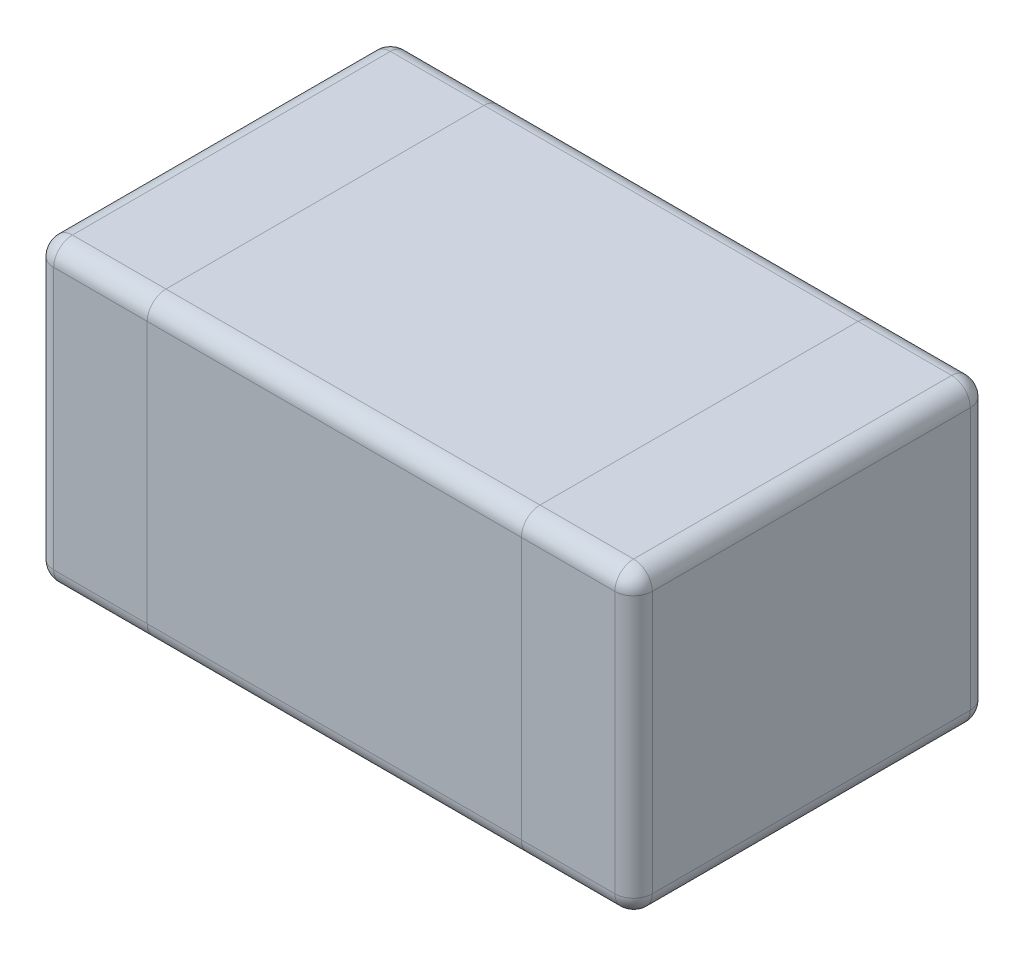
ISO-10303-21;
HEADER;
FILE_DESCRIPTION(('STEP AP214'),'2;1');
FILE_NAME('part.step','',(''),(''),'','','');
FILE_SCHEMA(('AUTOMOTIVE_DESIGN { 1 0 10303 214 1 1 1 1 }'));
ENDSEC;
DATA;
#1=APPLICATION_CONTEXT('core data for automotive mechanical design processes');
#2=APPLICATION_PROTOCOL_DEFINITION('international standard','automotive_design',2000,#1);
#3=PRODUCT_CONTEXT('',#1,'mechanical');
#4=PRODUCT('Part','Part','',(#3));
#5=PRODUCT_RELATED_PRODUCT_CATEGORY('part','',(#4));
#6=PRODUCT_DEFINITION_FORMATION('','',#4);
#7=PRODUCT_DEFINITION_CONTEXT('part definition',#1,'design');
#8=PRODUCT_DEFINITION('design','',#6,#7);
#9=PRODUCT_DEFINITION_SHAPE('','',#8);
#10=(LENGTH_UNIT() NAMED_UNIT(*) SI_UNIT(.MILLI.,.METRE.));
#11=(NAMED_UNIT(*) PLANE_ANGLE_UNIT() SI_UNIT($,.RADIAN.));
#12=(NAMED_UNIT(*) SI_UNIT($,.STERADIAN.) SOLID_ANGLE_UNIT());
#13=UNCERTAINTY_MEASURE_WITH_UNIT(LENGTH_MEASURE(1.E-05),#10,'distance_accuracy_value','');
#14=(GEOMETRIC_REPRESENTATION_CONTEXT(3) GLOBAL_UNCERTAINTY_ASSIGNED_CONTEXT((#13)) GLOBAL_UNIT_ASSIGNED_CONTEXT((#10,
#11,#12)) REPRESENTATION_CONTEXT('',''));
#15=CARTESIAN_POINT('',(0.,0.,0.));
#16=DIRECTION('',(0.,0.,1.));
#17=DIRECTION('',(1.,0.,0.));
#18=AXIS2_PLACEMENT_3D('',#15,#16,#17);
#19=CARTESIAN_POINT('',(0.8,0.40000254,0.95));
#20=DIRECTION('',(0.,0.,-1.));
#21=DIRECTION('',(0.,1.,0.));
#22=AXIS2_PLACEMENT_3D('',#19,#20,#21);
#23=PLANE('',#22);
#24=DIRECTION('',(0.,-1.,0.));
#25=VECTOR('',#24,1.);
#26=CARTESIAN_POINT('',(-0.5,0.40000254,0.95));
#27=LINE('',#26,#25);
#28=CARTESIAN_POINT('',(-0.5,0.35000254,0.95));
#29=VERTEX_POINT('',#28);
#30=CARTESIAN_POINT('',(-0.5,-0.34999746,0.95));
#31=VERTEX_POINT('',#30);
#32=EDGE_CURVE('E9',#29,#31,#27,.T.);
#33=ORIENTED_EDGE('',*,*,#32,.F.);
#34=DIRECTION('',(-1.,0.,0.));
#35=VECTOR('',#34,1.);
#36=CARTESIAN_POINT('',(0.8,0.35000254,0.95));
#37=LINE('',#36,#35);
#38=CARTESIAN_POINT('',(-0.75,0.35000254,0.95));
#39=VERTEX_POINT('',#38);
#40=EDGE_CURVE('E22',#29,#39,#37,.T.);
#41=ORIENTED_EDGE('',*,*,#40,.T.);
#42=DIRECTION('',(0.,-1.,0.));
#43=VECTOR('',#42,1.);
#44=CARTESIAN_POINT('',(-0.75,0.40000254,0.95));
#45=LINE('',#44,#43);
#46=CARTESIAN_POINT('',(-0.75,-0.34999746,0.95));
#47=VERTEX_POINT('',#46);
#48=EDGE_CURVE('E351',#39,#47,#45,.T.);
#49=ORIENTED_EDGE('',*,*,#48,.T.);
#50=DIRECTION('',(1.,0.,0.));
#51=VECTOR('',#50,1.);
#52=CARTESIAN_POINT('',(0.8,-0.34999746,0.95));
#53=LINE('',#52,#51);
#54=EDGE_CURVE('E349',#47,#31,#53,.T.);
#55=ORIENTED_EDGE('',*,*,#54,.T.);
#56=EDGE_LOOP('',(#33,#41,#49,#55));
#57=FACE_BOUND('',#56,.T.);
#58=ADVANCED_FACE('F15',(#57),#23,.F.);
#59=CARTESIAN_POINT('',(0.8,0.40000254,0.95));
#60=DIRECTION('',(0.,0.,-1.));
#61=DIRECTION('',(0.,1.,0.));
#62=AXIS2_PLACEMENT_3D('',#59,#60,#61);
#63=PLANE('',#62);
#64=DIRECTION('',(0.,1.,0.));
#65=VECTOR('',#64,1.);
#66=CARTESIAN_POINT('',(0.5,0.40000254,0.95));
#67=LINE('',#66,#65);
#68=CARTESIAN_POINT('',(0.5,-0.34999746,0.95));
#69=VERTEX_POINT('',#68);
#70=CARTESIAN_POINT('',(0.5,0.35000254,0.95));
#71=VERTEX_POINT('',#70);
#72=EDGE_CURVE('E347',#69,#71,#67,.T.);
#73=ORIENTED_EDGE('',*,*,#72,.F.);
#74=DIRECTION('',(1.,0.,0.));
#75=VECTOR('',#74,1.);
#76=CARTESIAN_POINT('',(0.8,-0.34999746,0.95));
#77=LINE('',#76,#75);
#78=CARTESIAN_POINT('',(0.75,-0.34999746,0.95));
#79=VERTEX_POINT('',#78);
#80=EDGE_CURVE('E345',#69,#79,#77,.T.);
#81=ORIENTED_EDGE('',*,*,#80,.T.);
#82=DIRECTION('',(0.,1.,0.));
#83=VECTOR('',#82,1.);
#84=CARTESIAN_POINT('',(0.75,0.40000254,0.95));
#85=LINE('',#84,#83);
#86=CARTESIAN_POINT('',(0.75,0.35000254,0.95));
#87=VERTEX_POINT('',#86);
#88=EDGE_CURVE('E343',#79,#87,#85,.T.);
#89=ORIENTED_EDGE('',*,*,#88,.T.);
#90=DIRECTION('',(-1.,0.,0.));
#91=VECTOR('',#90,1.);
#92=CARTESIAN_POINT('',(0.8,0.35000254,0.95));
#93=LINE('',#92,#91);
#94=EDGE_CURVE('E340',#87,#71,#93,.T.);
#95=ORIENTED_EDGE('',*,*,#94,.T.);
#96=EDGE_LOOP('',(#73,#81,#89,#95));
#97=FACE_BOUND('',#96,.T.);
#98=ADVANCED_FACE('F450',(#97),#63,.F.);
#99=CARTESIAN_POINT('',(0.8,-0.34999746,0.9));
#100=DIRECTION('',(1.,0.,0.));
#101=DIRECTION('',(0.,1.,0.));
#102=AXIS2_PLACEMENT_3D('',#99,#100,#101);
#103=CYLINDRICAL_SURFACE('',#102,0.05);
#104=DIRECTION('',(-1.,0.,0.));
#105=VECTOR('',#104,1.);
#106=CARTESIAN_POINT('',(-0.8,-0.39999746,0.9));
#107=LINE('',#106,#105);
#108=CARTESIAN_POINT('',(-0.5,-0.39999746,0.9));
#109=VERTEX_POINT('',#108);
#110=CARTESIAN_POINT('',(-0.75,-0.39999746,0.9));
#111=VERTEX_POINT('',#110);
#112=EDGE_CURVE('E338',#109,#111,#107,.T.);
#113=ORIENTED_EDGE('',*,*,#112,.F.);
#114=CARTESIAN_POINT('',(-0.5,-0.34999746,0.9));
#115=DIRECTION('',(-1.,0.,0.));
#116=DIRECTION('',(0.,1.,0.));
#117=AXIS2_PLACEMENT_3D('',#114,#115,#116);
#118=CIRCLE('',#117,0.05);
#119=EDGE_CURVE('E335',#109,#31,#118,.T.);
#120=ORIENTED_EDGE('',*,*,#119,.T.);
#121=ORIENTED_EDGE('',*,*,#54,.F.);
#122=CARTESIAN_POINT('',(-0.75,-0.34999746,0.9));
#123=DIRECTION('',(1.,0.,0.));
#124=DIRECTION('',(0.,0.,-1.));
#125=AXIS2_PLACEMENT_3D('',#122,#123,#124);
#126=CIRCLE('',#125,0.05);
#127=EDGE_CURVE('E332',#47,#111,#126,.T.);
#128=ORIENTED_EDGE('',*,*,#127,.T.);
#129=EDGE_LOOP('',(#113,#120,#121,#128));
#130=FACE_BOUND('',#129,.T.);
#131=ADVANCED_FACE('F454',(#130),#103,.T.);
#132=CARTESIAN_POINT('',(0.8,-0.34999746,0.9));
#133=DIRECTION('',(1.,0.,0.));
#134=DIRECTION('',(0.,1.,0.));
#135=AXIS2_PLACEMENT_3D('',#132,#133,#134);
#136=CYLINDRICAL_SURFACE('',#135,0.05);
#137=ORIENTED_EDGE('',*,*,#80,.F.);
#138=CARTESIAN_POINT('',(0.5,-0.34999746,0.9));
#139=DIRECTION('',(1.,0.,0.));
#140=DIRECTION('',(0.,-1.,0.));
#141=AXIS2_PLACEMENT_3D('',#138,#139,#140);
#142=CIRCLE('',#141,0.05);
#143=CARTESIAN_POINT('',(0.5,-0.39999746,0.9));
#144=VERTEX_POINT('',#143);
#145=EDGE_CURVE('E330',#69,#144,#142,.T.);
#146=ORIENTED_EDGE('',*,*,#145,.T.);
#147=DIRECTION('',(-1.,0.,0.));
#148=VECTOR('',#147,1.);
#149=CARTESIAN_POINT('',(-0.8,-0.39999746,0.9));
#150=LINE('',#149,#148);
#151=CARTESIAN_POINT('',(0.75,-0.39999746,0.9));
#152=VERTEX_POINT('',#151);
#153=EDGE_CURVE('E327',#152,#144,#150,.T.);
#154=ORIENTED_EDGE('',*,*,#153,.F.);
#155=CARTESIAN_POINT('',(0.75,-0.34999746,0.9));
#156=DIRECTION('',(1.,0.,0.));
#157=DIRECTION('',(0.,1.,0.));
#158=AXIS2_PLACEMENT_3D('',#155,#156,#157);
#159=CIRCLE('',#158,0.05);
#160=EDGE_CURVE('E324',#79,#152,#159,.T.);
#161=ORIENTED_EDGE('',*,*,#160,.F.);
#162=EDGE_LOOP('',(#137,#146,#154,#161));
#163=FACE_BOUND('',#162,.T.);
#164=ADVANCED_FACE('F459',(#163),#136,.T.);
#165=CARTESIAN_POINT('',(-0.8,-0.39999746,0.95));
#166=DIRECTION('',(0.,1.,0.));
#167=DIRECTION('',(0.,0.,-1.));
#168=AXIS2_PLACEMENT_3D('',#165,#166,#167);
#169=PLANE('',#168);
#170=DIRECTION('',(0.,0.,-1.));
#171=VECTOR('',#170,1.);
#172=CARTESIAN_POINT('',(-0.5,-0.39999746,0.95));
#173=LINE('',#172,#171);
#174=CARTESIAN_POINT('',(-0.5,-0.39999746,0.05));
#175=VERTEX_POINT('',#174);
#176=EDGE_CURVE('E322',#109,#175,#173,.T.);
#177=ORIENTED_EDGE('',*,*,#176,.F.);
#178=ORIENTED_EDGE('',*,*,#112,.T.);
#179=DIRECTION('',(0.,0.,-1.));
#180=VECTOR('',#179,1.);
#181=CARTESIAN_POINT('',(-0.75,-0.39999746,0.95));
#182=LINE('',#181,#180);
#183=CARTESIAN_POINT('',(-0.75,-0.39999746,0.05));
#184=VERTEX_POINT('',#183);
#185=EDGE_CURVE('E320',#111,#184,#182,.T.);
#186=ORIENTED_EDGE('',*,*,#185,.T.);
#187=DIRECTION('',(1.,0.,0.));
#188=VECTOR('',#187,1.);
#189=CARTESIAN_POINT('',(0.8,-0.39999746,0.05));
#190=LINE('',#189,#188);
#191=EDGE_CURVE('E317',#184,#175,#190,.T.);
#192=ORIENTED_EDGE('',*,*,#191,.T.);
#193=EDGE_LOOP('',(#177,#178,#186,#192));
#194=FACE_BOUND('',#193,.T.);
#195=ADVANCED_FACE('F465',(#194),#169,.F.);
#196=CARTESIAN_POINT('',(-0.8,-0.39999746,0.95));
#197=DIRECTION('',(0.,1.,0.));
#198=DIRECTION('',(0.,0.,-1.));
#199=AXIS2_PLACEMENT_3D('',#196,#197,#198);
#200=PLANE('',#199);
#201=DIRECTION('',(0.,0.,1.));
#202=VECTOR('',#201,1.);
#203=CARTESIAN_POINT('',(0.5,-0.39999746,0.95));
#204=LINE('',#203,#202);
#205=CARTESIAN_POINT('',(0.5,-0.39999746,0.05));
#206=VERTEX_POINT('',#205);
#207=EDGE_CURVE('E314',#206,#144,#204,.T.);
#208=ORIENTED_EDGE('',*,*,#207,.F.);
#209=DIRECTION('',(1.,0.,0.));
#210=VECTOR('',#209,1.);
#211=CARTESIAN_POINT('',(0.8,-0.39999746,0.05));
#212=LINE('',#211,#210);
#213=CARTESIAN_POINT('',(0.75,-0.39999746,0.05));
#214=VERTEX_POINT('',#213);
#215=EDGE_CURVE('E311',#206,#214,#212,.T.);
#216=ORIENTED_EDGE('',*,*,#215,.T.);
#217=DIRECTION('',(0.,0.,1.));
#218=VECTOR('',#217,1.);
#219=CARTESIAN_POINT('',(0.75,-0.39999746,0.95));
#220=LINE('',#219,#218);
#221=EDGE_CURVE('E308',#214,#152,#220,.T.);
#222=ORIENTED_EDGE('',*,*,#221,.T.);
#223=ORIENTED_EDGE('',*,*,#153,.T.);
#224=EDGE_LOOP('',(#208,#216,#222,#223));
#225=FACE_BOUND('',#224,.T.);
#226=ADVANCED_FACE('F390',(#225),#200,.F.);
#227=CARTESIAN_POINT('',(-0.8,-0.34999746,0.05));
#228=DIRECTION('',(-1.,0.,0.));
#229=DIRECTION('',(0.,-1.,0.));
#230=AXIS2_PLACEMENT_3D('',#227,#228,#229);
#231=CYLINDRICAL_SURFACE('',#230,0.05);
#232=DIRECTION('',(-1.,0.,0.));
#233=VECTOR('',#232,1.);
#234=CARTESIAN_POINT('',(-0.8,-0.34999746,0.));
#235=LINE('',#234,#233);
#236=CARTESIAN_POINT('',(-0.5,-0.34999746,0.));
#237=VERTEX_POINT('',#236);
#238=CARTESIAN_POINT('',(-0.75,-0.34999746,0.));
#239=VERTEX_POINT('',#238);
#240=EDGE_CURVE('E305',#237,#239,#235,.T.);
#241=ORIENTED_EDGE('',*,*,#240,.F.);
#242=CARTESIAN_POINT('',(-0.5,-0.34999746,0.05));
#243=DIRECTION('',(-1.,0.,0.));
#244=DIRECTION('',(0.,1.,0.));
#245=AXIS2_PLACEMENT_3D('',#242,#243,#244);
#246=CIRCLE('',#245,0.05);
#247=EDGE_CURVE('E302',#237,#175,#246,.T.);
#248=ORIENTED_EDGE('',*,*,#247,.T.);
#249=ORIENTED_EDGE('',*,*,#191,.F.);
#250=CARTESIAN_POINT('',(-0.75,-0.34999746,0.05));
#251=DIRECTION('',(1.,0.,0.));
#252=DIRECTION('',(0.,-1.,0.));
#253=AXIS2_PLACEMENT_3D('',#250,#251,#252);
#254=CIRCLE('',#253,0.05);
#255=EDGE_CURVE('E299',#184,#239,#254,.T.);
#256=ORIENTED_EDGE('',*,*,#255,.T.);
#257=EDGE_LOOP('',(#241,#248,#249,#256));
#258=FACE_BOUND('',#257,.T.);
#259=ADVANCED_FACE('F377',(#258),#231,.T.);
#260=CARTESIAN_POINT('',(-0.8,-0.34999746,0.05));
#261=DIRECTION('',(-1.,0.,0.));
#262=DIRECTION('',(0.,-1.,0.));
#263=AXIS2_PLACEMENT_3D('',#260,#261,#262);
#264=CYLINDRICAL_SURFACE('',#263,0.05);
#265=ORIENTED_EDGE('',*,*,#215,.F.);
#266=CARTESIAN_POINT('',(0.5,-0.34999746,0.05));
#267=DIRECTION('',(1.,0.,0.));
#268=DIRECTION('',(0.,-1.,0.));
#269=AXIS2_PLACEMENT_3D('',#266,#267,#268);
#270=CIRCLE('',#269,0.05);
#271=CARTESIAN_POINT('',(0.5,-0.34999746,0.));
#272=VERTEX_POINT('',#271);
#273=EDGE_CURVE('E296',#206,#272,#270,.T.);
#274=ORIENTED_EDGE('',*,*,#273,.T.);
#275=DIRECTION('',(-1.,0.,0.));
#276=VECTOR('',#275,1.);
#277=CARTESIAN_POINT('',(-0.8,-0.34999746,0.));
#278=LINE('',#277,#276);
#279=CARTESIAN_POINT('',(0.75,-0.34999746,0.));
#280=VERTEX_POINT('',#279);
#281=EDGE_CURVE('E293',#280,#272,#278,.T.);
#282=ORIENTED_EDGE('',*,*,#281,.F.);
#283=CARTESIAN_POINT('',(0.75,-0.34999746,0.05));
#284=DIRECTION('',(1.,0.,0.));
#285=DIRECTION('',(0.,1.,0.));
#286=AXIS2_PLACEMENT_3D('',#283,#284,#285);
#287=CIRCLE('',#286,0.05);
#288=EDGE_CURVE('E290',#214,#280,#287,.T.);
#289=ORIENTED_EDGE('',*,*,#288,.F.);
#290=EDGE_LOOP('',(#265,#274,#282,#289));
#291=FACE_BOUND('',#290,.T.);
#292=ADVANCED_FACE('F395',(#291),#264,.T.);
#293=CARTESIAN_POINT('',(0.8,0.40000254,0.));
#294=DIRECTION('',(0.,0.,-1.));
#295=DIRECTION('',(0.,1.,0.));
#296=AXIS2_PLACEMENT_3D('',#293,#294,#295);
#297=PLANE('',#296);
#298=DIRECTION('',(1.,0.,0.));
#299=VECTOR('',#298,1.);
#300=CARTESIAN_POINT('',(0.8,0.35000254,0.));
#301=LINE('',#300,#299);
#302=CARTESIAN_POINT('',(-0.75,0.35000254,0.));
#303=VERTEX_POINT('',#302);
#304=CARTESIAN_POINT('',(-0.5,0.35000254,0.));
#305=VERTEX_POINT('',#304);
#306=EDGE_CURVE('E287',#303,#305,#301,.T.);
#307=ORIENTED_EDGE('',*,*,#306,.T.);
#308=DIRECTION('',(0.,-1.,0.));
#309=VECTOR('',#308,1.);
#310=CARTESIAN_POINT('',(-0.5,0.40000254,0.));
#311=LINE('',#310,#309);
#312=EDGE_CURVE('E284',#305,#237,#311,.T.);
#313=ORIENTED_EDGE('',*,*,#312,.T.);
#314=ORIENTED_EDGE('',*,*,#240,.T.);
#315=DIRECTION('',(0.,1.,0.));
#316=VECTOR('',#315,1.);
#317=CARTESIAN_POINT('',(-0.75,0.40000254,0.));
#318=LINE('',#317,#316);
#319=EDGE_CURVE('E282',#239,#303,#318,.T.);
#320=ORIENTED_EDGE('',*,*,#319,.T.);
#321=EDGE_LOOP('',(#307,#313,#314,#320));
#322=FACE_BOUND('',#321,.T.);
#323=ADVANCED_FACE('F372',(#322),#297,.T.);
#324=CARTESIAN_POINT('',(0.8,0.40000254,0.));
#325=DIRECTION('',(0.,0.,-1.));
#326=DIRECTION('',(0.,1.,0.));
#327=AXIS2_PLACEMENT_3D('',#324,#325,#326);
#328=PLANE('',#327);
#329=ORIENTED_EDGE('',*,*,#281,.T.);
#330=DIRECTION('',(0.,1.,0.));
#331=VECTOR('',#330,1.);
#332=CARTESIAN_POINT('',(0.5,0.40000254,0.));
#333=LINE('',#332,#331);
#334=CARTESIAN_POINT('',(0.5,0.35000254,0.));
#335=VERTEX_POINT('',#334);
#336=EDGE_CURVE('E279',#272,#335,#333,.T.);
#337=ORIENTED_EDGE('',*,*,#336,.T.);
#338=DIRECTION('',(1.,0.,0.));
#339=VECTOR('',#338,1.);
#340=CARTESIAN_POINT('',(0.8,0.35000254,0.));
#341=LINE('',#340,#339);
#342=CARTESIAN_POINT('',(0.75,0.35000254,0.));
#343=VERTEX_POINT('',#342);
#344=EDGE_CURVE('E276',#335,#343,#341,.T.);
#345=ORIENTED_EDGE('',*,*,#344,.T.);
#346=DIRECTION('',(0.,-1.,0.));
#347=VECTOR('',#346,1.);
#348=CARTESIAN_POINT('',(0.75,-0.39999746,0.));
#349=LINE('',#348,#347);
#350=EDGE_CURVE('E273',#343,#280,#349,.T.);
#351=ORIENTED_EDGE('',*,*,#350,.T.);
#352=EDGE_LOOP('',(#329,#337,#345,#351));
#353=FACE_BOUND('',#352,.T.);
#354=ADVANCED_FACE('F405',(#353),#328,.T.);
#355=CARTESIAN_POINT('',(0.8,0.35000254,0.9));
#356=DIRECTION('',(-1.,0.,0.));
#357=DIRECTION('',(0.,-1.,0.));
#358=AXIS2_PLACEMENT_3D('',#355,#356,#357);
#359=CYLINDRICAL_SURFACE('',#358,0.05);
#360=ORIENTED_EDGE('',*,*,#40,.F.);
#361=CARTESIAN_POINT('',(-0.5,0.35000254,0.9));
#362=DIRECTION('',(-1.,0.,0.));
#363=DIRECTION('',(0.,1.,0.));
#364=AXIS2_PLACEMENT_3D('',#361,#362,#363);
#365=CIRCLE('',#364,0.05);
#366=CARTESIAN_POINT('',(-0.5,0.40000254,0.9));
#367=VERTEX_POINT('',#366);
#368=EDGE_CURVE('E270',#29,#367,#365,.T.);
#369=ORIENTED_EDGE('',*,*,#368,.T.);
#370=DIRECTION('',(1.,0.,0.));
#371=VECTOR('',#370,1.);
#372=CARTESIAN_POINT('',(-0.8,0.40000254,0.9));
#373=LINE('',#372,#371);
#374=CARTESIAN_POINT('',(-0.75,0.40000254,0.9));
#375=VERTEX_POINT('',#374);
#376=EDGE_CURVE('E267',#375,#367,#373,.T.);
#377=ORIENTED_EDGE('',*,*,#376,.F.);
#378=CARTESIAN_POINT('',(-0.75,0.35000254,0.9));
#379=DIRECTION('',(1.,0.,0.));
#380=DIRECTION('',(0.,-1.,0.));
#381=AXIS2_PLACEMENT_3D('',#378,#379,#380);
#382=CIRCLE('',#381,0.05);
#383=EDGE_CURVE('E264',#375,#39,#382,.T.);
#384=ORIENTED_EDGE('',*,*,#383,.T.);
#385=EDGE_LOOP('',(#360,#369,#377,#384));
#386=FACE_BOUND('',#385,.T.);
#387=ADVANCED_FACE('F363',(#386),#359,.T.);
#388=CARTESIAN_POINT('',(0.8,0.35000254,0.9));
#389=DIRECTION('',(-1.,0.,0.));
#390=DIRECTION('',(0.,-1.,0.));
#391=AXIS2_PLACEMENT_3D('',#388,#389,#390);
#392=CYLINDRICAL_SURFACE('',#391,0.05);
#393=DIRECTION('',(1.,0.,0.));
#394=VECTOR('',#393,1.);
#395=CARTESIAN_POINT('',(-0.8,0.40000254,0.9));
#396=LINE('',#395,#394);
#397=CARTESIAN_POINT('',(0.5,0.40000254,0.9));
#398=VERTEX_POINT('',#397);
#399=CARTESIAN_POINT('',(0.75,0.40000254,0.9));
#400=VERTEX_POINT('',#399);
#401=EDGE_CURVE('E261',#398,#400,#396,.T.);
#402=ORIENTED_EDGE('',*,*,#401,.F.);
#403=CARTESIAN_POINT('',(0.5,0.35000254,0.9));
#404=DIRECTION('',(1.,0.,0.));
#405=DIRECTION('',(0.,-1.,0.));
#406=AXIS2_PLACEMENT_3D('',#403,#404,#405);
#407=CIRCLE('',#406,0.05);
#408=EDGE_CURVE('E258',#398,#71,#407,.T.);
#409=ORIENTED_EDGE('',*,*,#408,.T.);
#410=ORIENTED_EDGE('',*,*,#94,.F.);
#411=CARTESIAN_POINT('',(0.75,0.35000254,0.9));
#412=DIRECTION('',(1.,0.,0.));
#413=DIRECTION('',(0.,0.,1.));
#414=AXIS2_PLACEMENT_3D('',#411,#412,#413);
#415=CIRCLE('',#414,0.05);
#416=EDGE_CURVE('E255',#400,#87,#415,.T.);
#417=ORIENTED_EDGE('',*,*,#416,.F.);
#418=EDGE_LOOP('',(#402,#409,#410,#417));
#419=FACE_BOUND('',#418,.T.);
#420=ADVANCED_FACE('F482',(#419),#392,.T.);
#421=CARTESIAN_POINT('',(-0.8,0.35000254,0.05));
#422=DIRECTION('',(1.,0.,0.));
#423=DIRECTION('',(0.,1.,0.));
#424=AXIS2_PLACEMENT_3D('',#421,#422,#423);
#425=CYLINDRICAL_SURFACE('',#424,0.05);
#426=DIRECTION('',(-1.,0.,0.));
#427=VECTOR('',#426,1.);
#428=CARTESIAN_POINT('',(-0.8,0.40000254,0.05));
#429=LINE('',#428,#427);
#430=CARTESIAN_POINT('',(-0.5,0.40000254,0.05));
#431=VERTEX_POINT('',#430);
#432=CARTESIAN_POINT('',(-0.75,0.40000254,0.05));
#433=VERTEX_POINT('',#432);
#434=EDGE_CURVE('E253',#431,#433,#429,.T.);
#435=ORIENTED_EDGE('',*,*,#434,.F.);
#436=CARTESIAN_POINT('',(-0.5,0.35000254,0.05));
#437=DIRECTION('',(-1.,0.,0.));
#438=DIRECTION('',(0.,1.,0.));
#439=AXIS2_PLACEMENT_3D('',#436,#437,#438);
#440=CIRCLE('',#439,0.05);
#441=EDGE_CURVE('E250',#431,#305,#440,.T.);
#442=ORIENTED_EDGE('',*,*,#441,.T.);
#443=ORIENTED_EDGE('',*,*,#306,.F.);
#444=CARTESIAN_POINT('',(-0.75,0.35000254,0.05));
#445=DIRECTION('',(1.,0.,0.));
#446=DIRECTION('',(0.,-1.,0.));
#447=AXIS2_PLACEMENT_3D('',#444,#445,#446);
#448=CIRCLE('',#447,0.05);
#449=EDGE_CURVE('E182',#303,#433,#448,.T.);
#450=ORIENTED_EDGE('',*,*,#449,.T.);
#451=EDGE_LOOP('',(#435,#442,#443,#450));
#452=FACE_BOUND('',#451,.T.);
#453=ADVANCED_FACE('F370',(#452),#425,.T.);
#454=CARTESIAN_POINT('',(-0.8,0.35000254,0.05));
#455=DIRECTION('',(1.,0.,0.));
#456=DIRECTION('',(0.,1.,0.));
#457=AXIS2_PLACEMENT_3D('',#454,#455,#456);
#458=CYLINDRICAL_SURFACE('',#457,0.05);
#459=ORIENTED_EDGE('',*,*,#344,.F.);
#460=CARTESIAN_POINT('',(0.5,0.35000254,0.05));
#461=DIRECTION('',(1.,0.,0.));
#462=DIRECTION('',(0.,-1.,0.));
#463=AXIS2_PLACEMENT_3D('',#460,#461,#462);
#464=CIRCLE('',#463,0.05);
#465=CARTESIAN_POINT('',(0.5,0.40000254,0.05));
#466=VERTEX_POINT('',#465);
#467=EDGE_CURVE('E246',#335,#466,#464,.T.);
#468=ORIENTED_EDGE('',*,*,#467,.T.);
#469=DIRECTION('',(-1.,0.,0.));
#470=VECTOR('',#469,1.);
#471=CARTESIAN_POINT('',(-0.8,0.40000254,0.05));
#472=LINE('',#471,#470);
#473=CARTESIAN_POINT('',(0.75,0.40000254,0.05));
#474=VERTEX_POINT('',#473);
#475=EDGE_CURVE('E243',#474,#466,#472,.T.);
#476=ORIENTED_EDGE('',*,*,#475,.F.);
#477=CARTESIAN_POINT('',(0.75,0.35000254,0.05));
#478=DIRECTION('',(1.,0.,0.));
#479=DIRECTION('',(0.,1.,0.));
#480=AXIS2_PLACEMENT_3D('',#477,#478,#479);
#481=CIRCLE('',#480,0.05);
#482=EDGE_CURVE('E240',#343,#474,#481,.T.);
#483=ORIENTED_EDGE('',*,*,#482,.F.);
#484=EDGE_LOOP('',(#459,#468,#476,#483));
#485=FACE_BOUND('',#484,.T.);
#486=ADVANCED_FACE('F434',(#485),#458,.T.);
#487=CARTESIAN_POINT('',(-0.8,0.40000254,0.95));
#488=DIRECTION('',(0.,-1.,0.));
#489=DIRECTION('',(1.,0.,0.));
#490=AXIS2_PLACEMENT_3D('',#487,#488,#489);
#491=PLANE('',#490);
#492=DIRECTION('',(0.,0.,1.));
#493=VECTOR('',#492,1.);
#494=CARTESIAN_POINT('',(-0.5,0.40000254,0.95));
#495=LINE('',#494,#493);
#496=EDGE_CURVE('E238',#431,#367,#495,.T.);
#497=ORIENTED_EDGE('',*,*,#496,.F.);
#498=ORIENTED_EDGE('',*,*,#434,.T.);
#499=DIRECTION('',(0.,0.,1.));
#500=VECTOR('',#499,1.);
#501=CARTESIAN_POINT('',(-0.75,0.40000254,0.95));
#502=LINE('',#501,#500);
#503=EDGE_CURVE('E173',#433,#375,#502,.T.);
#504=ORIENTED_EDGE('',*,*,#503,.T.);
#505=ORIENTED_EDGE('',*,*,#376,.T.);
#506=EDGE_LOOP('',(#497,#498,#504,#505));
#507=FACE_BOUND('',#506,.T.);
#508=ADVANCED_FACE('F366',(#507),#491,.F.);
#509=CARTESIAN_POINT('',(-0.8,0.40000254,0.95));
#510=DIRECTION('',(0.,-1.,0.));
#511=DIRECTION('',(1.,0.,0.));
#512=AXIS2_PLACEMENT_3D('',#509,#510,#511);
#513=PLANE('',#512);
#514=DIRECTION('',(0.,0.,-1.));
#515=VECTOR('',#514,1.);
#516=CARTESIAN_POINT('',(0.5,0.40000254,0.95));
#517=LINE('',#516,#515);
#518=EDGE_CURVE('E235',#398,#466,#517,.T.);
#519=ORIENTED_EDGE('',*,*,#518,.F.);
#520=ORIENTED_EDGE('',*,*,#401,.T.);
#521=DIRECTION('',(0.,0.,-1.));
#522=VECTOR('',#521,1.);
#523=CARTESIAN_POINT('',(0.75,0.40000254,0.95));
#524=LINE('',#523,#522);
#525=EDGE_CURVE('E233',#400,#474,#524,.T.);
#526=ORIENTED_EDGE('',*,*,#525,.T.);
#527=ORIENTED_EDGE('',*,*,#475,.T.);
#528=EDGE_LOOP('',(#519,#520,#526,#527));
#529=FACE_BOUND('',#528,.T.);
#530=ADVANCED_FACE('F492',(#529),#513,.F.);
#531=CARTESIAN_POINT('',(0.8,-0.39999746,0.95));
#532=DIRECTION('',(-1.,0.,0.));
#533=DIRECTION('',(0.,-1.,0.));
#534=AXIS2_PLACEMENT_3D('',#531,#532,#533);
#535=PLANE('',#534);
#536=DIRECTION('',(0.,0.,1.));
#537=VECTOR('',#536,1.);
#538=CARTESIAN_POINT('',(0.8,0.35000254,0.95));
#539=LINE('',#538,#537);
#540=CARTESIAN_POINT('',(0.8,0.35000254,0.05));
#541=VERTEX_POINT('',#540);
#542=CARTESIAN_POINT('',(0.8,0.35000254,0.9));
#543=VERTEX_POINT('',#542);
#544=EDGE_CURVE('E231',#541,#543,#539,.T.);
#545=ORIENTED_EDGE('',*,*,#544,.T.);
#546=DIRECTION('',(0.,-1.,0.));
#547=VECTOR('',#546,1.);
#548=CARTESIAN_POINT('',(0.8,-0.39999746,0.9));
#549=LINE('',#548,#547);
#550=CARTESIAN_POINT('',(0.8,-0.34999746,0.9));
#551=VERTEX_POINT('',#550);
#552=EDGE_CURVE('E229',#543,#551,#549,.T.);
#553=ORIENTED_EDGE('',*,*,#552,.T.);
#554=DIRECTION('',(0.,0.,-1.));
#555=VECTOR('',#554,1.);
#556=CARTESIAN_POINT('',(0.8,-0.34999746,0.95));
#557=LINE('',#556,#555);
#558=CARTESIAN_POINT('',(0.8,-0.34999746,0.05));
#559=VERTEX_POINT('',#558);
#560=EDGE_CURVE('E227',#551,#559,#557,.T.);
#561=ORIENTED_EDGE('',*,*,#560,.T.);
#562=DIRECTION('',(0.,1.,0.));
#563=VECTOR('',#562,1.);
#564=CARTESIAN_POINT('',(0.8,0.40000254,0.05));
#565=LINE('',#564,#563);
#566=EDGE_CURVE('E224',#559,#541,#565,.T.);
#567=ORIENTED_EDGE('',*,*,#566,.T.);
#568=EDGE_LOOP('',(#545,#553,#561,#567));
#569=FACE_BOUND('',#568,.T.);
#570=ADVANCED_FACE('F495',(#569),#535,.F.);
#571=CARTESIAN_POINT('',(-0.8,0.40000254,0.95));
#572=DIRECTION('',(0.,-1.,0.));
#573=DIRECTION('',(1.,0.,0.));
#574=AXIS2_PLACEMENT_3D('',#571,#572,#573);
#575=PLANE('',#574);
#576=DIRECTION('',(-1.,0.,0.));
#577=VECTOR('',#576,1.);
#578=CARTESIAN_POINT('',(-0.8,0.40000254,0.05));
#579=LINE('',#578,#577);
#580=EDGE_CURVE('E221',#466,#431,#579,.T.);
#581=ORIENTED_EDGE('',*,*,#580,.T.);
#582=ORIENTED_EDGE('',*,*,#496,.T.);
#583=DIRECTION('',(1.,0.,0.));
#584=VECTOR('',#583,1.);
#585=CARTESIAN_POINT('',(-0.8,0.40000254,0.9));
#586=LINE('',#585,#584);
#587=EDGE_CURVE('E218',#367,#398,#586,.T.);
#588=ORIENTED_EDGE('',*,*,#587,.T.);
#589=ORIENTED_EDGE('',*,*,#518,.T.);
#590=EDGE_LOOP('',(#581,#582,#588,#589));
#591=FACE_BOUND('',#590,.T.);
#592=ADVANCED_FACE('F498',(#591),#575,.F.);
#593=CARTESIAN_POINT('',(-0.8,-0.39999746,0.95));
#594=DIRECTION('',(1.,0.,0.));
#595=DIRECTION('',(0.,0.,1.));
#596=AXIS2_PLACEMENT_3D('',#593,#594,#595);
#597=PLANE('',#596);
#598=DIRECTION('',(0.,0.,1.));
#599=VECTOR('',#598,1.);
#600=CARTESIAN_POINT('',(-0.8,-0.34999746,0.95));
#601=LINE('',#600,#599);
#602=CARTESIAN_POINT('',(-0.8,-0.34999746,0.05));
#603=VERTEX_POINT('',#602);
#604=CARTESIAN_POINT('',(-0.8,-0.34999746,0.9));
#605=VERTEX_POINT('',#604);
#606=EDGE_CURVE('E216',#603,#605,#601,.T.);
#607=ORIENTED_EDGE('',*,*,#606,.T.);
#608=DIRECTION('',(0.,1.,0.));
#609=VECTOR('',#608,1.);
#610=CARTESIAN_POINT('',(-0.8,-0.39999746,0.9));
#611=LINE('',#610,#609);
#612=CARTESIAN_POINT('',(-0.8,0.35000254,0.9));
#613=VERTEX_POINT('',#612);
#614=EDGE_CURVE('E154',#605,#613,#611,.T.);
#615=ORIENTED_EDGE('',*,*,#614,.T.);
#616=DIRECTION('',(0.,0.,-1.));
#617=VECTOR('',#616,1.);
#618=CARTESIAN_POINT('',(-0.8,0.35000254,0.95));
#619=LINE('',#618,#617);
#620=CARTESIAN_POINT('',(-0.8,0.35000254,0.05));
#621=VERTEX_POINT('',#620);
#622=EDGE_CURVE('E148',#613,#621,#619,.T.);
#623=ORIENTED_EDGE('',*,*,#622,.T.);
#624=DIRECTION('',(0.,-1.,0.));
#625=VECTOR('',#624,1.);
#626=CARTESIAN_POINT('',(-0.8,-0.39999746,0.05));
#627=LINE('',#626,#625);
#628=EDGE_CURVE('E151',#621,#603,#627,.T.);
#629=ORIENTED_EDGE('',*,*,#628,.T.);
#630=EDGE_LOOP('',(#607,#615,#623,#629));
#631=FACE_BOUND('',#630,.T.);
#632=ADVANCED_FACE('F150',(#631),#597,.F.);
#633=CARTESIAN_POINT('',(-0.8,-0.39999746,0.95));
#634=DIRECTION('',(0.,1.,0.));
#635=DIRECTION('',(0.,0.,-1.));
#636=AXIS2_PLACEMENT_3D('',#633,#634,#635);
#637=PLANE('',#636);
#638=DIRECTION('',(-1.,0.,0.));
#639=VECTOR('',#638,1.);
#640=CARTESIAN_POINT('',(-0.8,-0.39999746,0.9));
#641=LINE('',#640,#639);
#642=EDGE_CURVE('E168',#144,#109,#641,.T.);
#643=ORIENTED_EDGE('',*,*,#642,.T.);
#644=ORIENTED_EDGE('',*,*,#176,.T.);
#645=DIRECTION('',(1.,0.,0.));
#646=VECTOR('',#645,1.);
#647=CARTESIAN_POINT('',(0.8,-0.39999746,0.05));
#648=LINE('',#647,#646);
#649=EDGE_CURVE('E211',#175,#206,#648,.T.);
#650=ORIENTED_EDGE('',*,*,#649,.T.);
#651=ORIENTED_EDGE('',*,*,#207,.T.);
#652=EDGE_LOOP('',(#643,#644,#650,#651));
#653=FACE_BOUND('',#652,.T.);
#654=ADVANCED_FACE('F386',(#653),#637,.F.);
#655=CARTESIAN_POINT('',(0.8,0.40000254,0.95));
#656=DIRECTION('',(0.,0.,-1.));
#657=DIRECTION('',(0.,1.,0.));
#658=AXIS2_PLACEMENT_3D('',#655,#656,#657);
#659=PLANE('',#658);
#660=DIRECTION('',(-1.,0.,0.));
#661=VECTOR('',#660,1.);
#662=CARTESIAN_POINT('',(0.8,0.35000254,0.95));
#663=LINE('',#662,#661);
#664=EDGE_CURVE('E209',#71,#29,#663,.T.);
#665=ORIENTED_EDGE('',*,*,#664,.T.);
#666=ORIENTED_EDGE('',*,*,#32,.T.);
#667=DIRECTION('',(1.,0.,0.));
#668=VECTOR('',#667,1.);
#669=CARTESIAN_POINT('',(0.8,-0.34999746,0.95));
#670=LINE('',#669,#668);
#671=EDGE_CURVE('E207',#31,#69,#670,.T.);
#672=ORIENTED_EDGE('',*,*,#671,.T.);
#673=ORIENTED_EDGE('',*,*,#72,.T.);
#674=EDGE_LOOP('',(#665,#666,#672,#673));
#675=FACE_BOUND('',#674,.T.);
#676=ADVANCED_FACE('F507',(#675),#659,.F.);
#677=CARTESIAN_POINT('',(0.8,0.40000254,0.));
#678=DIRECTION('',(0.,0.,-1.));
#679=DIRECTION('',(0.,1.,0.));
#680=AXIS2_PLACEMENT_3D('',#677,#678,#679);
#681=PLANE('',#680);
#682=ORIENTED_EDGE('',*,*,#312,.F.);
#683=DIRECTION('',(1.,0.,0.));
#684=VECTOR('',#683,1.);
#685=CARTESIAN_POINT('',(0.8,0.35000254,0.));
#686=LINE('',#685,#684);
#687=EDGE_CURVE('E205',#305,#335,#686,.T.);
#688=ORIENTED_EDGE('',*,*,#687,.T.);
#689=ORIENTED_EDGE('',*,*,#336,.F.);
#690=DIRECTION('',(-1.,0.,0.));
#691=VECTOR('',#690,1.);
#692=CARTESIAN_POINT('',(-0.8,-0.34999746,0.));
#693=LINE('',#692,#691);
#694=EDGE_CURVE('E203',#272,#237,#693,.T.);
#695=ORIENTED_EDGE('',*,*,#694,.T.);
#696=EDGE_LOOP('',(#682,#688,#689,#695));
#697=FACE_BOUND('',#696,.T.);
#698=ADVANCED_FACE('F510',(#697),#681,.T.);
#699=CARTESIAN_POINT('',(-0.75,-0.34999746,0.95));
#700=DIRECTION('',(0.,0.,-1.));
#701=DIRECTION('',(0.,1.,0.));
#702=AXIS2_PLACEMENT_3D('',#699,#700,#701);
#703=CYLINDRICAL_SURFACE('',#702,0.05);
#704=CARTESIAN_POINT('',(-0.75,-0.34999746,0.9));
#705=DIRECTION('',(0.,0.,1.));
#706=DIRECTION('',(0.,-1.,0.));
#707=AXIS2_PLACEMENT_3D('',#704,#705,#706);
#708=CIRCLE('',#707,0.05);
#709=EDGE_CURVE('E200',#605,#111,#708,.T.);
#710=ORIENTED_EDGE('',*,*,#709,.F.);
#711=ORIENTED_EDGE('',*,*,#606,.F.);
#712=CARTESIAN_POINT('',(-0.75,-0.34999746,0.05));
#713=DIRECTION('',(0.,0.,-1.));
#714=DIRECTION('',(0.,1.,0.));
#715=AXIS2_PLACEMENT_3D('',#712,#713,#714);
#716=CIRCLE('',#715,0.05);
#717=EDGE_CURVE('E198',#184,#603,#716,.T.);
#718=ORIENTED_EDGE('',*,*,#717,.F.);
#719=ORIENTED_EDGE('',*,*,#185,.F.);
#720=EDGE_LOOP('',(#710,#711,#718,#719));
#721=FACE_BOUND('',#720,.T.);
#722=ADVANCED_FACE('F513',(#721),#703,.T.);
#723=CARTESIAN_POINT('',(-0.75,-0.34999746,0.9));
#724=DIRECTION('',(0.,1.,0.));
#725=DIRECTION('',(1.,0.,0.));
#726=AXIS2_PLACEMENT_3D('',#723,#724,#725);
#727=SPHERICAL_SURFACE('',#726,0.05);
#728=CARTESIAN_POINT('',(-0.75,-0.34999746,0.9));
#729=DIRECTION('',(0.,1.,0.));
#730=DIRECTION('',(1.,0.,0.));
#731=AXIS2_PLACEMENT_3D('',#728,#729,#730);
#732=CIRCLE('',#731,0.05);
#733=EDGE_CURVE('E195',#605,#47,#732,.T.);
#734=ORIENTED_EDGE('',*,*,#733,.F.);
#735=ORIENTED_EDGE('',*,*,#709,.T.);
#736=ORIENTED_EDGE('',*,*,#127,.F.);
#737=EDGE_LOOP('',(#734,#735,#736));
#738=FACE_BOUND('',#737,.T.);
#739=ADVANCED_FACE('F517',(#738),#727,.T.);
#740=CARTESIAN_POINT('',(-0.75,-0.34999746,0.05));
#741=DIRECTION('',(0.,1.,0.));
#742=DIRECTION('',(1.,0.,0.));
#743=AXIS2_PLACEMENT_3D('',#740,#741,#742);
#744=SPHERICAL_SURFACE('',#743,0.05);
#745=ORIENTED_EDGE('',*,*,#255,.F.);
#746=ORIENTED_EDGE('',*,*,#717,.T.);
#747=CARTESIAN_POINT('',(-0.75,-0.34999746,0.05));
#748=DIRECTION('',(0.,1.,0.));
#749=DIRECTION('',(1.,0.,0.));
#750=AXIS2_PLACEMENT_3D('',#747,#748,#749);
#751=CIRCLE('',#750,0.05);
#752=EDGE_CURVE('E166',#239,#603,#751,.T.);
#753=ORIENTED_EDGE('',*,*,#752,.F.);
#754=EDGE_LOOP('',(#745,#746,#753));
#755=FACE_BOUND('',#754,.T.);
#756=ADVANCED_FACE('F521',(#755),#744,.T.);
#757=CARTESIAN_POINT('',(0.8,-0.34999746,0.9));
#758=DIRECTION('',(1.,0.,0.));
#759=DIRECTION('',(0.,1.,0.));
#760=AXIS2_PLACEMENT_3D('',#757,#758,#759);
#761=CYLINDRICAL_SURFACE('',#760,0.05);
#762=ORIENTED_EDGE('',*,*,#119,.F.);
#763=ORIENTED_EDGE('',*,*,#642,.F.);
#764=ORIENTED_EDGE('',*,*,#145,.F.);
#765=ORIENTED_EDGE('',*,*,#671,.F.);
#766=EDGE_LOOP('',(#762,#763,#764,#765));
#767=FACE_BOUND('',#766,.T.);
#768=ADVANCED_FACE('F525',(#767),#761,.T.);
#769=CARTESIAN_POINT('',(-0.75,0.40000254,0.9));
#770=DIRECTION('',(0.,-1.,0.));
#771=DIRECTION('',(1.,0.,0.));
#772=AXIS2_PLACEMENT_3D('',#769,#770,#771);
#773=CYLINDRICAL_SURFACE('',#772,0.05);
#774=ORIENTED_EDGE('',*,*,#733,.T.);
#775=ORIENTED_EDGE('',*,*,#48,.F.);
#776=CARTESIAN_POINT('',(-0.75,0.35000254,0.9));
#777=DIRECTION('',(0.,1.,0.));
#778=DIRECTION('',(-1.,0.,0.));
#779=AXIS2_PLACEMENT_3D('',#776,#777,#778);
#780=CIRCLE('',#779,0.05);
#781=EDGE_CURVE('E177',#613,#39,#780,.T.);
#782=ORIENTED_EDGE('',*,*,#781,.F.);
#783=ORIENTED_EDGE('',*,*,#614,.F.);
#784=EDGE_LOOP('',(#774,#775,#782,#783));
#785=FACE_BOUND('',#784,.T.);
#786=ADVANCED_FACE('F357',(#785),#773,.T.);
#787=CARTESIAN_POINT('',(-0.75,0.35000254,0.95));
#788=DIRECTION('',(0.,0.,-1.));
#789=DIRECTION('',(0.,1.,0.));
#790=AXIS2_PLACEMENT_3D('',#787,#788,#789);
#791=CYLINDRICAL_SURFACE('',#790,0.05);
#792=CARTESIAN_POINT('',(-0.75,0.35000254,0.05));
#793=DIRECTION('',(0.,0.,-1.));
#794=DIRECTION('',(0.,1.,0.));
#795=AXIS2_PLACEMENT_3D('',#792,#793,#794);
#796=CIRCLE('',#795,0.05);
#797=EDGE_CURVE('E171',#621,#433,#796,.T.);
#798=ORIENTED_EDGE('',*,*,#797,.F.);
#799=ORIENTED_EDGE('',*,*,#622,.F.);
#800=CARTESIAN_POINT('',(-0.75,0.35000254,0.9));
#801=DIRECTION('',(0.,0.,1.));
#802=DIRECTION('',(0.,-1.,0.));
#803=AXIS2_PLACEMENT_3D('',#800,#801,#802);
#804=CIRCLE('',#803,0.05);
#805=EDGE_CURVE('E178',#375,#613,#804,.T.);
#806=ORIENTED_EDGE('',*,*,#805,.F.);
#807=ORIENTED_EDGE('',*,*,#503,.F.);
#808=EDGE_LOOP('',(#798,#799,#806,#807));
#809=FACE_BOUND('',#808,.T.);
#810=ADVANCED_FACE('F172',(#809),#791,.T.);
#811=CARTESIAN_POINT('',(-0.75,-0.39999746,0.05));
#812=DIRECTION('',(0.,1.,0.));
#813=DIRECTION('',(-1.,0.,0.));
#814=AXIS2_PLACEMENT_3D('',#811,#812,#813);
#815=CYLINDRICAL_SURFACE('',#814,0.05);
#816=ORIENTED_EDGE('',*,*,#752,.T.);
#817=ORIENTED_EDGE('',*,*,#628,.F.);
#818=CARTESIAN_POINT('',(-0.75,0.35000254,0.05));
#819=DIRECTION('',(0.,1.,0.));
#820=DIRECTION('',(-1.,0.,0.));
#821=AXIS2_PLACEMENT_3D('',#818,#819,#820);
#822=CIRCLE('',#821,0.05);
#823=EDGE_CURVE('E164',#303,#621,#822,.T.);
#824=ORIENTED_EDGE('',*,*,#823,.F.);
#825=ORIENTED_EDGE('',*,*,#319,.F.);
#826=EDGE_LOOP('',(#816,#817,#824,#825));
#827=FACE_BOUND('',#826,.T.);
#828=ADVANCED_FACE('F161',(#827),#815,.T.);
#829=CARTESIAN_POINT('',(-0.8,-0.34999746,0.05));
#830=DIRECTION('',(-1.,0.,0.));
#831=DIRECTION('',(0.,-1.,0.));
#832=AXIS2_PLACEMENT_3D('',#829,#830,#831);
#833=CYLINDRICAL_SURFACE('',#832,0.05);
#834=ORIENTED_EDGE('',*,*,#247,.F.);
#835=ORIENTED_EDGE('',*,*,#694,.F.);
#836=ORIENTED_EDGE('',*,*,#273,.F.);
#837=ORIENTED_EDGE('',*,*,#649,.F.);
#838=EDGE_LOOP('',(#834,#835,#836,#837));
#839=FACE_BOUND('',#838,.T.);
#840=ADVANCED_FACE('F382',(#839),#833,.T.);
#841=CARTESIAN_POINT('',(0.75,-0.34999746,0.95));
#842=DIRECTION('',(0.,0.,-1.));
#843=DIRECTION('',(0.,1.,0.));
#844=AXIS2_PLACEMENT_3D('',#841,#842,#843);
#845=CYLINDRICAL_SURFACE('',#844,0.05);
#846=CARTESIAN_POINT('',(0.75,-0.34999746,0.9));
#847=DIRECTION('',(0.,0.,1.));
#848=DIRECTION('',(0.,-1.,0.));
#849=AXIS2_PLACEMENT_3D('',#846,#847,#848);
#850=CIRCLE('',#849,0.05);
#851=EDGE_CURVE('E184',#152,#551,#850,.T.);
#852=ORIENTED_EDGE('',*,*,#851,.F.);
#853=ORIENTED_EDGE('',*,*,#221,.F.);
#854=CARTESIAN_POINT('',(0.75,-0.34999746,0.05));
#855=DIRECTION('',(0.,0.,-1.));
#856=DIRECTION('',(0.,1.,0.));
#857=AXIS2_PLACEMENT_3D('',#854,#855,#856);
#858=CIRCLE('',#857,0.05);
#859=EDGE_CURVE('E188',#559,#214,#858,.T.);
#860=ORIENTED_EDGE('',*,*,#859,.F.);
#861=ORIENTED_EDGE('',*,*,#560,.F.);
#862=EDGE_LOOP('',(#852,#853,#860,#861));
#863=FACE_BOUND('',#862,.T.);
#864=ADVANCED_FACE('F538',(#863),#845,.T.);
#865=CARTESIAN_POINT('',(0.75,-0.34999746,0.9));
#866=DIRECTION('',(0.,1.,0.));
#867=DIRECTION('',(1.,0.,0.));
#868=AXIS2_PLACEMENT_3D('',#865,#866,#867);
#869=SPHERICAL_SURFACE('',#868,0.05);
#870=ORIENTED_EDGE('',*,*,#160,.T.);
#871=ORIENTED_EDGE('',*,*,#851,.T.);
#872=CARTESIAN_POINT('',(0.75,-0.34999746,0.9));
#873=DIRECTION('',(0.,1.,0.));
#874=DIRECTION('',(1.,0.,0.));
#875=AXIS2_PLACEMENT_3D('',#872,#873,#874);
#876=CIRCLE('',#875,0.05);
#877=EDGE_CURVE('E414',#79,#551,#876,.T.);
#878=ORIENTED_EDGE('',*,*,#877,.F.);
#879=EDGE_LOOP('',(#870,#871,#878));
#880=FACE_BOUND('',#879,.T.);
#881=ADVANCED_FACE('F541',(#880),#869,.T.);
#882=CARTESIAN_POINT('',(-0.75,0.35000254,0.9));
#883=DIRECTION('',(0.,1.,0.));
#884=DIRECTION('',(1.,0.,0.));
#885=AXIS2_PLACEMENT_3D('',#882,#883,#884);
#886=SPHERICAL_SURFACE('',#885,0.05);
#887=ORIENTED_EDGE('',*,*,#805,.T.);
#888=ORIENTED_EDGE('',*,*,#781,.T.);
#889=ORIENTED_EDGE('',*,*,#383,.F.);
#890=EDGE_LOOP('',(#887,#888,#889));
#891=FACE_BOUND('',#890,.T.);
#892=ADVANCED_FACE('F361',(#891),#886,.T.);
#893=CARTESIAN_POINT('',(-0.75,0.35000254,0.05));
#894=DIRECTION('',(0.,1.,0.));
#895=DIRECTION('',(1.,0.,0.));
#896=AXIS2_PLACEMENT_3D('',#893,#894,#895);
#897=SPHERICAL_SURFACE('',#896,0.05);
#898=ORIENTED_EDGE('',*,*,#823,.T.);
#899=ORIENTED_EDGE('',*,*,#797,.T.);
#900=ORIENTED_EDGE('',*,*,#449,.F.);
#901=EDGE_LOOP('',(#898,#899,#900));
#902=FACE_BOUND('',#901,.T.);
#903=ADVANCED_FACE('F180',(#902),#897,.T.);
#904=CARTESIAN_POINT('',(0.75,-0.34999746,0.05));
#905=DIRECTION('',(0.,1.,0.));
#906=DIRECTION('',(1.,0.,0.));
#907=AXIS2_PLACEMENT_3D('',#904,#905,#906);
#908=SPHERICAL_SURFACE('',#907,0.05);
#909=ORIENTED_EDGE('',*,*,#859,.T.);
#910=ORIENTED_EDGE('',*,*,#288,.T.);
#911=CARTESIAN_POINT('',(0.75,-0.34999746,0.05));
#912=DIRECTION('',(0.,1.,0.));
#913=DIRECTION('',(1.,0.,0.));
#914=AXIS2_PLACEMENT_3D('',#911,#912,#913);
#915=CIRCLE('',#914,0.05);
#916=EDGE_CURVE('E401',#559,#280,#915,.T.);
#917=ORIENTED_EDGE('',*,*,#916,.F.);
#918=EDGE_LOOP('',(#909,#910,#917));
#919=FACE_BOUND('',#918,.T.);
#920=ADVANCED_FACE('F400',(#919),#908,.T.);
#921=CARTESIAN_POINT('',(0.75,0.40000254,0.9));
#922=DIRECTION('',(0.,1.,0.));
#923=DIRECTION('',(-1.,0.,0.));
#924=AXIS2_PLACEMENT_3D('',#921,#922,#923);
#925=CYLINDRICAL_SURFACE('',#924,0.05);
#926=ORIENTED_EDGE('',*,*,#877,.T.);
#927=ORIENTED_EDGE('',*,*,#552,.F.);
#928=CARTESIAN_POINT('',(0.75,0.35000254,0.9));
#929=DIRECTION('',(0.,1.,0.));
#930=DIRECTION('',(-1.,0.,0.));
#931=AXIS2_PLACEMENT_3D('',#928,#929,#930);
#932=CIRCLE('',#931,0.05);
#933=EDGE_CURVE('E415',#87,#543,#932,.T.);
#934=ORIENTED_EDGE('',*,*,#933,.F.);
#935=ORIENTED_EDGE('',*,*,#88,.F.);
#936=EDGE_LOOP('',(#926,#927,#934,#935));
#937=FACE_BOUND('',#936,.T.);
#938=ADVANCED_FACE('F552',(#937),#925,.T.);
#939=CARTESIAN_POINT('',(0.8,0.35000254,0.9));
#940=DIRECTION('',(-1.,0.,0.));
#941=DIRECTION('',(0.,-1.,0.));
#942=AXIS2_PLACEMENT_3D('',#939,#940,#941);
#943=CYLINDRICAL_SURFACE('',#942,0.05);
#944=ORIENTED_EDGE('',*,*,#368,.F.);
#945=ORIENTED_EDGE('',*,*,#664,.F.);
#946=ORIENTED_EDGE('',*,*,#408,.F.);
#947=ORIENTED_EDGE('',*,*,#587,.F.);
#948=EDGE_LOOP('',(#944,#945,#946,#947));
#949=FACE_BOUND('',#948,.T.);
#950=ADVANCED_FACE('F555',(#949),#943,.T.);
#951=CARTESIAN_POINT('',(-0.8,0.35000254,0.05));
#952=DIRECTION('',(1.,0.,0.));
#953=DIRECTION('',(0.,1.,0.));
#954=AXIS2_PLACEMENT_3D('',#951,#952,#953);
#955=CYLINDRICAL_SURFACE('',#954,0.05);
#956=ORIENTED_EDGE('',*,*,#441,.F.);
#957=ORIENTED_EDGE('',*,*,#580,.F.);
#958=ORIENTED_EDGE('',*,*,#467,.F.);
#959=ORIENTED_EDGE('',*,*,#687,.F.);
#960=EDGE_LOOP('',(#956,#957,#958,#959));
#961=FACE_BOUND('',#960,.T.);
#962=ADVANCED_FACE('F559',(#961),#955,.T.);
#963=CARTESIAN_POINT('',(0.75,-0.39999746,0.05));
#964=DIRECTION('',(0.,-1.,0.));
#965=DIRECTION('',(1.,0.,0.));
#966=AXIS2_PLACEMENT_3D('',#963,#964,#965);
#967=CYLINDRICAL_SURFACE('',#966,0.05);
#968=ORIENTED_EDGE('',*,*,#916,.T.);
#969=ORIENTED_EDGE('',*,*,#350,.F.);
#970=CARTESIAN_POINT('',(0.75,0.35000254,0.05));
#971=DIRECTION('',(0.,1.,0.));
#972=DIRECTION('',(-1.,0.,0.));
#973=AXIS2_PLACEMENT_3D('',#970,#971,#972);
#974=CIRCLE('',#973,0.05);
#975=EDGE_CURVE('E412',#541,#343,#974,.T.);
#976=ORIENTED_EDGE('',*,*,#975,.F.);
#977=ORIENTED_EDGE('',*,*,#566,.F.);
#978=EDGE_LOOP('',(#968,#969,#976,#977));
#979=FACE_BOUND('',#978,.T.);
#980=ADVANCED_FACE('F410',(#979),#967,.T.);
#981=CARTESIAN_POINT('',(0.75,0.35000254,0.9));
#982=DIRECTION('',(0.,1.,0.));
#983=DIRECTION('',(1.,0.,0.));
#984=AXIS2_PLACEMENT_3D('',#981,#982,#983);
#985=SPHERICAL_SURFACE('',#984,0.05);
#986=ORIENTED_EDGE('',*,*,#416,.T.);
#987=ORIENTED_EDGE('',*,*,#933,.T.);
#988=CARTESIAN_POINT('',(0.75,0.35000254,0.9));
#989=DIRECTION('',(0.,0.,-1.));
#990=DIRECTION('',(0.,-1.,0.));
#991=AXIS2_PLACEMENT_3D('',#988,#989,#990);
#992=CIRCLE('',#991,0.05);
#993=EDGE_CURVE('E423',#400,#543,#992,.T.);
#994=ORIENTED_EDGE('',*,*,#993,.F.);
#995=EDGE_LOOP('',(#986,#987,#994));
#996=FACE_BOUND('',#995,.T.);
#997=ADVANCED_FACE('F439',(#996),#985,.T.);
#998=CARTESIAN_POINT('',(0.75,0.35000254,0.05));
#999=DIRECTION('',(0.,1.,0.));
#1000=DIRECTION('',(1.,0.,0.));
#1001=AXIS2_PLACEMENT_3D('',#998,#999,#1000);
#1002=SPHERICAL_SURFACE('',#1001,0.05);
#1003=ORIENTED_EDGE('',*,*,#975,.T.);
#1004=ORIENTED_EDGE('',*,*,#482,.T.);
#1005=CARTESIAN_POINT('',(0.75,0.35000254,0.05));
#1006=DIRECTION('',(0.,0.,1.));
#1007=DIRECTION('',(0.,1.,0.));
#1008=AXIS2_PLACEMENT_3D('',#1005,#1006,#1007);
#1009=CIRCLE('',#1008,0.05);
#1010=EDGE_CURVE('E426',#541,#474,#1009,.T.);
#1011=ORIENTED_EDGE('',*,*,#1010,.F.);
#1012=EDGE_LOOP('',(#1003,#1004,#1011));
#1013=FACE_BOUND('',#1012,.T.);
#1014=ADVANCED_FACE('F437',(#1013),#1002,.T.);
#1015=CARTESIAN_POINT('',(0.75,0.35000254,0.95));
#1016=DIRECTION('',(0.,0.,-1.));
#1017=DIRECTION('',(0.,1.,0.));
#1018=AXIS2_PLACEMENT_3D('',#1015,#1016,#1017);
#1019=CYLINDRICAL_SURFACE('',#1018,0.05);
#1020=ORIENTED_EDGE('',*,*,#993,.T.);
#1021=ORIENTED_EDGE('',*,*,#544,.F.);
#1022=ORIENTED_EDGE('',*,*,#1010,.T.);
#1023=ORIENTED_EDGE('',*,*,#525,.F.);
#1024=EDGE_LOOP('',(#1020,#1021,#1022,#1023));
#1025=FACE_BOUND('',#1024,.T.);
#1026=ADVANCED_FACE('F430',(#1025),#1019,.T.);
#1027=CLOSED_SHELL('',(#58,#98,#131,#164,#195,#226,#259,#292,#323,#354,#387,#420,#453,#486,#508,
#530,#570,#592,#632,#654,#676,#698,#722,#739,#756,#768,#786,#810,#828,#840,#864,#881,#892,#903,
#920,#938,#950,#962,#980,#997,#1014,#1026));
#1028=MANIFOLD_SOLID_BREP('B1',#1027);
#1029=ADVANCED_BREP_SHAPE_REPRESENTATION('',(#18,#1028),#14);
#1030=SHAPE_DEFINITION_REPRESENTATION(#9,#1029);
ENDSEC;
END-ISO-10303-21;
